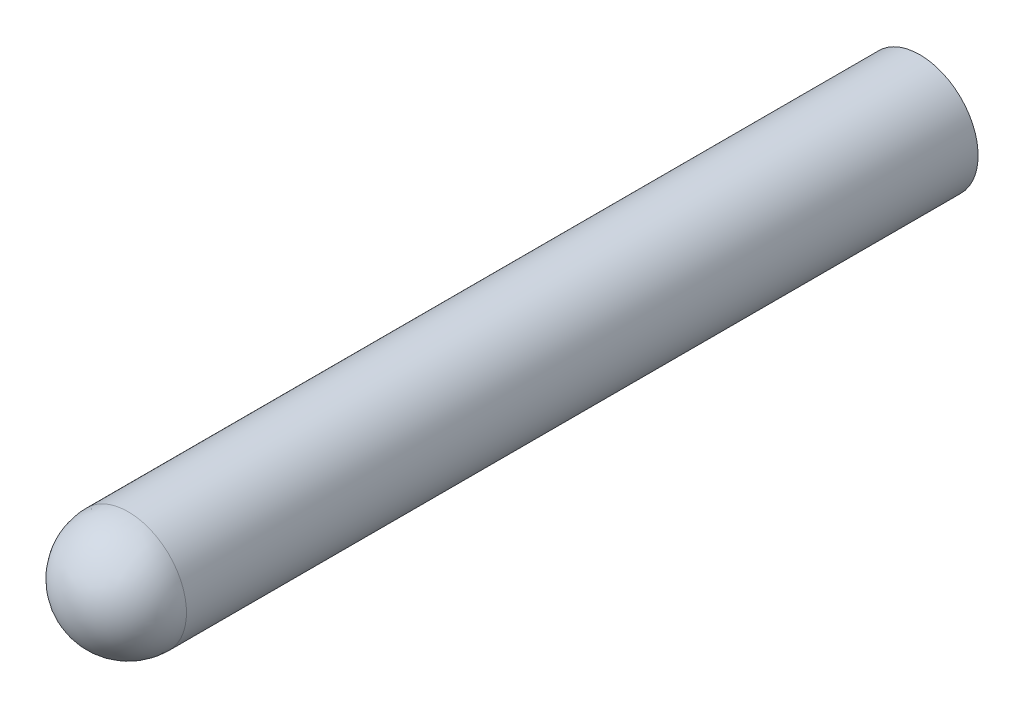
ISO-10303-21;
HEADER;
FILE_DESCRIPTION(('STEP AP214'),'2;1');
FILE_NAME('part.step','',(''),(''),'','','');
FILE_SCHEMA(('AUTOMOTIVE_DESIGN { 1 0 10303 214 1 1 1 1 }'));
ENDSEC;
DATA;
#1=APPLICATION_CONTEXT('core data for automotive mechanical design processes');
#2=APPLICATION_PROTOCOL_DEFINITION('international standard','automotive_design',2000,#1);
#3=PRODUCT_CONTEXT('',#1,'mechanical');
#4=PRODUCT('Part','Part','',(#3));
#5=PRODUCT_RELATED_PRODUCT_CATEGORY('part','',(#4));
#6=PRODUCT_DEFINITION_FORMATION('','',#4);
#7=PRODUCT_DEFINITION_CONTEXT('part definition',#1,'design');
#8=PRODUCT_DEFINITION('design','',#6,#7);
#9=PRODUCT_DEFINITION_SHAPE('','',#8);
#10=(LENGTH_UNIT() NAMED_UNIT(*) SI_UNIT(.MILLI.,.METRE.));
#11=(NAMED_UNIT(*) PLANE_ANGLE_UNIT() SI_UNIT($,.RADIAN.));
#12=(NAMED_UNIT(*) SI_UNIT($,.STERADIAN.) SOLID_ANGLE_UNIT());
#13=UNCERTAINTY_MEASURE_WITH_UNIT(LENGTH_MEASURE(1.E-05),#10,'distance_accuracy_value','');
#14=(GEOMETRIC_REPRESENTATION_CONTEXT(3) GLOBAL_UNCERTAINTY_ASSIGNED_CONTEXT((#13)) GLOBAL_UNIT_ASSIGNED_CONTEXT((#10,
#11,#12)) REPRESENTATION_CONTEXT('',''));
#15=CARTESIAN_POINT('',(0.,0.,0.));
#16=DIRECTION('',(0.,0.,1.));
#17=DIRECTION('',(1.,0.,0.));
#18=AXIS2_PLACEMENT_3D('',#15,#16,#17);
#19=CARTESIAN_POINT('',(0.,0.,-0.5));
#20=DIRECTION('',(0.,0.,-1.));
#21=DIRECTION('',(-1.,0.,0.));
#22=AXIS2_PLACEMENT_3D('',#19,#20,#21);
#23=PLANE('',#22);
#24=CARTESIAN_POINT('',(0.,0.,-0.5));
#25=DIRECTION('',(0.,0.,-1.));
#26=DIRECTION('',(-1.,0.,0.));
#27=AXIS2_PLACEMENT_3D('',#24,#25,#26);
#28=CIRCLE('',#27,12.5);
#29=CARTESIAN_POINT('',(-12.5,0.,-0.5));
#30=VERTEX_POINT('',#29);
#31=EDGE_CURVE('E42',#30,#30,#28,.T.);
#32=ORIENTED_EDGE('',*,*,#31,.T.);
#33=EDGE_LOOP('',(#32));
#34=FACE_BOUND('',#33,.T.);
#35=ADVANCED_FACE('F19',(#34),#23,.T.);
#36=CARTESIAN_POINT('',(0.,0.,169.36751346));
#37=DIRECTION('',(-1.,0.,0.));
#38=DIRECTION('',(0.,0.,-1.));
#39=AXIS2_PLACEMENT_3D('',#36,#37,#38);
#40=SPHERICAL_SURFACE('',#39,12.5);
#41=CARTESIAN_POINT('',(0.,0.,169.36751346));
#42=DIRECTION('',(0.,0.,-1.));
#43=DIRECTION('',(0.997207189611507,0.0746848109532261,0.));
#44=AXIS2_PLACEMENT_3D('',#41,#42,#43);
#45=CIRCLE('',#44,12.5);
#46=CARTESIAN_POINT('',(12.4650898701438,0.933560136915335,169.36751346));
#47=VERTEX_POINT('',#46);
#48=CARTESIAN_POINT('',(12.4650898701438,-0.933560136915335,169.36751346));
#49=VERTEX_POINT('',#48);
#50=EDGE_CURVE('E12',#47,#49,#45,.T.);
#51=ORIENTED_EDGE('',*,*,#50,.F.);
#52=CARTESIAN_POINT('',(0.,0.,169.36751346));
#53=DIRECTION('',(0.,0.,-1.));
#54=DIRECTION('',(-1.,0.,0.));
#55=AXIS2_PLACEMENT_3D('',#52,#53,#54);
#56=CIRCLE('',#55,12.5);
#57=EDGE_CURVE('E31',#49,#47,#56,.T.);
#58=ORIENTED_EDGE('',*,*,#57,.F.);
#59=EDGE_LOOP('',(#51,#58));
#60=FACE_BOUND('',#59,.T.);
#61=ADVANCED_FACE('F21',(#60),#40,.T.);
#62=CARTESIAN_POINT('',(0.,0.,169.36751346));
#63=DIRECTION('',(0.,0.,-1.));
#64=DIRECTION('',(-1.,0.,0.));
#65=AXIS2_PLACEMENT_3D('',#62,#63,#64);
#66=CYLINDRICAL_SURFACE('',#65,12.5);
#67=ORIENTED_EDGE('',*,*,#31,.F.);
#68=EDGE_LOOP('',(#67));
#69=FACE_BOUND('',#68,.T.);
#70=ORIENTED_EDGE('',*,*,#57,.T.);
#71=ORIENTED_EDGE('',*,*,#50,.T.);
#72=EDGE_LOOP('',(#70,#71));
#73=FACE_BOUND('',#72,.T.);
#74=ADVANCED_FACE('F41',(#69,#73),#66,.T.);
#75=CLOSED_SHELL('',(#35,#61,#74));
#76=MANIFOLD_SOLID_BREP('B1',#75);
#77=ADVANCED_BREP_SHAPE_REPRESENTATION('',(#18,#76),#14);
#78=SHAPE_DEFINITION_REPRESENTATION(#9,#77);
ENDSEC;
END-ISO-10303-21;
